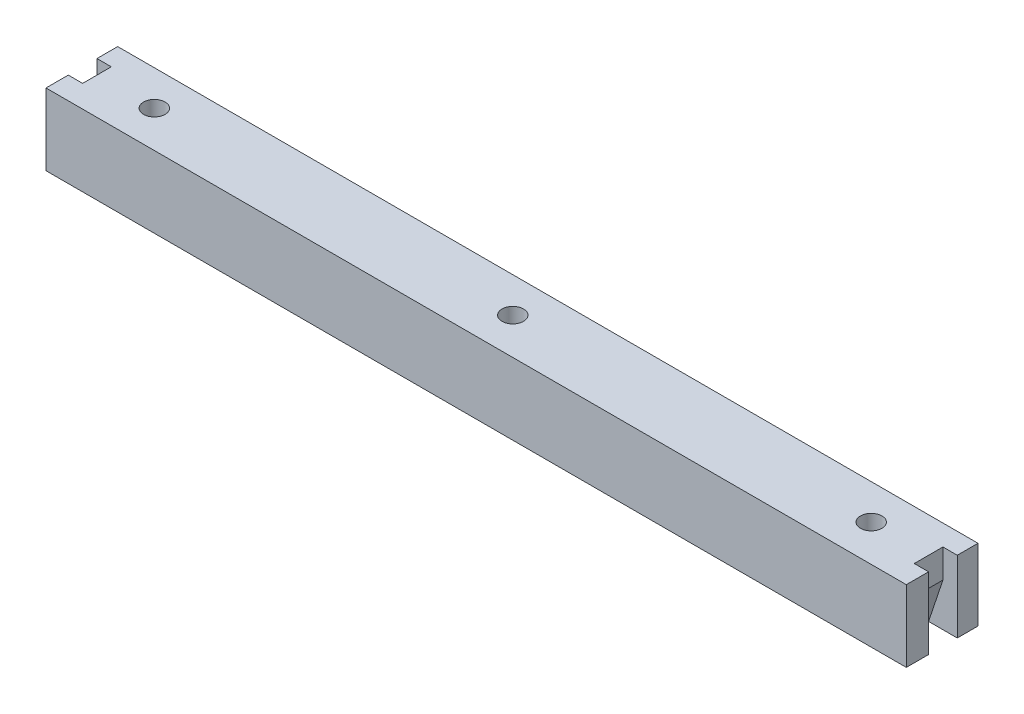
ISO-10303-21;
HEADER;
FILE_DESCRIPTION(('STEP AP214'),'2;1');
FILE_NAME('part.step','',(''),(''),'','','');
FILE_SCHEMA(('AUTOMOTIVE_DESIGN { 1 0 10303 214 1 1 1 1 }'));
ENDSEC;
DATA;
#1=APPLICATION_CONTEXT('core data for automotive mechanical design processes');
#2=APPLICATION_PROTOCOL_DEFINITION('international standard','automotive_design',2000,#1);
#3=PRODUCT_CONTEXT('',#1,'mechanical');
#4=PRODUCT('Part','Part','',(#3));
#5=PRODUCT_RELATED_PRODUCT_CATEGORY('part','',(#4));
#6=PRODUCT_DEFINITION_FORMATION('','',#4);
#7=PRODUCT_DEFINITION_CONTEXT('part definition',#1,'design');
#8=PRODUCT_DEFINITION('design','',#6,#7);
#9=PRODUCT_DEFINITION_SHAPE('','',#8);
#10=(LENGTH_UNIT() NAMED_UNIT(*) SI_UNIT(.MILLI.,.METRE.));
#11=(NAMED_UNIT(*) PLANE_ANGLE_UNIT() SI_UNIT($,.RADIAN.));
#12=(NAMED_UNIT(*) SI_UNIT($,.STERADIAN.) SOLID_ANGLE_UNIT());
#13=UNCERTAINTY_MEASURE_WITH_UNIT(LENGTH_MEASURE(1.E-05),#10,'distance_accuracy_value','');
#14=(GEOMETRIC_REPRESENTATION_CONTEXT(3) GLOBAL_UNCERTAINTY_ASSIGNED_CONTEXT((#13)) GLOBAL_UNIT_ASSIGNED_CONTEXT((#10,
#11,#12)) REPRESENTATION_CONTEXT('',''));
#15=CARTESIAN_POINT('',(0.,0.,0.));
#16=DIRECTION('',(0.,0.,1.));
#17=DIRECTION('',(1.,0.,0.));
#18=AXIS2_PLACEMENT_3D('',#15,#16,#17);
#19=CARTESIAN_POINT('',(60.,10.,-4.89208633093525));
#20=DIRECTION('',(-1.,0.,0.));
#21=DIRECTION('',(0.,0.,1.));
#22=AXIS2_PLACEMENT_3D('',#19,#20,#21);
#23=PLANE('',#22);
#24=DIRECTION('',(0.,1.,0.));
#25=VECTOR('',#24,1.);
#26=CARTESIAN_POINT('',(60.,10.,-2.));
#27=LINE('',#26,#25);
#28=CARTESIAN_POINT('',(60.,0.,-2.));
#29=VERTEX_POINT('',#28);
#30=CARTESIAN_POINT('',(60.,10.,-2.));
#31=VERTEX_POINT('',#30);
#32=EDGE_CURVE('E254',#29,#31,#27,.T.);
#33=ORIENTED_EDGE('',*,*,#32,.F.);
#34=DIRECTION('',(0.,0.,-1.));
#35=VECTOR('',#34,1.);
#36=CARTESIAN_POINT('',(60.,0.,-4.89208633093525));
#37=LINE('',#36,#35);
#38=CARTESIAN_POINT('',(60.,0.,-4.89208633093525));
#39=VERTEX_POINT('',#38);
#40=EDGE_CURVE('E230',#29,#39,#37,.T.);
#41=ORIENTED_EDGE('',*,*,#40,.T.);
#42=DIRECTION('',(0.,-1.,0.));
#43=VECTOR('',#42,1.);
#44=CARTESIAN_POINT('',(60.,10.,-4.89208633093525));
#45=LINE('',#44,#43);
#46=CARTESIAN_POINT('',(60.,10.,-4.89208633093525));
#47=VERTEX_POINT('',#46);
#48=EDGE_CURVE('E238',#47,#39,#45,.T.);
#49=ORIENTED_EDGE('',*,*,#48,.F.);
#50=DIRECTION('',(0.,0.,-1.));
#51=VECTOR('',#50,1.);
#52=CARTESIAN_POINT('',(60.,10.,-4.89208633093525));
#53=LINE('',#52,#51);
#54=EDGE_CURVE('E218',#31,#47,#53,.T.);
#55=ORIENTED_EDGE('',*,*,#54,.F.);
#56=EDGE_LOOP('',(#33,#41,#49,#55));
#57=FACE_BOUND('',#56,.T.);
#58=ADVANCED_FACE('F33',(#57),#23,.F.);
#59=CARTESIAN_POINT('',(0.,10.,0.));
#60=DIRECTION('',(0.,1.,0.));
#61=DIRECTION('',(0.,0.,1.));
#62=AXIS2_PLACEMENT_3D('',#59,#60,#61);
#63=PLANE('',#62);
#64=DIRECTION('',(1.,0.,0.));
#65=VECTOR('',#64,1.);
#66=CARTESIAN_POINT('',(0.,10.,2.));
#67=LINE('',#66,#65);
#68=CARTESIAN_POINT('',(58.,10.,2.));
#69=VERTEX_POINT('',#68);
#70=CARTESIAN_POINT('',(60.,10.,2.));
#71=VERTEX_POINT('',#70);
#72=EDGE_CURVE('E166',#69,#71,#67,.T.);
#73=ORIENTED_EDGE('',*,*,#72,.F.);
#74=DIRECTION('',(0.,0.,-1.));
#75=VECTOR('',#74,1.);
#76=CARTESIAN_POINT('',(58.,10.,0.));
#77=LINE('',#76,#75);
#78=CARTESIAN_POINT('',(58.,10.,-2.));
#79=VERTEX_POINT('',#78);
#80=EDGE_CURVE('E11',#69,#79,#77,.T.);
#81=ORIENTED_EDGE('',*,*,#80,.T.);
#82=DIRECTION('',(1.,0.,0.));
#83=VECTOR('',#82,1.);
#84=CARTESIAN_POINT('',(0.,10.,-2.));
#85=LINE('',#84,#83);
#86=EDGE_CURVE('E140',#79,#31,#85,.T.);
#87=ORIENTED_EDGE('',*,*,#86,.T.);
#88=ORIENTED_EDGE('',*,*,#54,.T.);
#89=DIRECTION('',(-1.,0.,0.));
#90=VECTOR('',#89,1.);
#91=CARTESIAN_POINT('',(-60.,10.,-4.89208633093525));
#92=LINE('',#91,#90);
#93=CARTESIAN_POINT('',(-60.,10.,-4.89208633093525));
#94=VERTEX_POINT('',#93);
#95=EDGE_CURVE('E222',#47,#94,#92,.T.);
#96=ORIENTED_EDGE('',*,*,#95,.T.);
#97=DIRECTION('',(0.,0.,1.));
#98=VECTOR('',#97,1.);
#99=CARTESIAN_POINT('',(-60.,10.,-4.89208633093525));
#100=LINE('',#99,#98);
#101=CARTESIAN_POINT('',(-60.,10.,-2.));
#102=VERTEX_POINT('',#101);
#103=EDGE_CURVE('E212',#94,#102,#100,.T.);
#104=ORIENTED_EDGE('',*,*,#103,.T.);
#105=DIRECTION('',(-1.,0.,0.));
#106=VECTOR('',#105,1.);
#107=CARTESIAN_POINT('',(0.,10.,-2.));
#108=LINE('',#107,#106);
#109=CARTESIAN_POINT('',(-58.,10.,-2.));
#110=VERTEX_POINT('',#109);
#111=EDGE_CURVE('E56',#110,#102,#108,.T.);
#112=ORIENTED_EDGE('',*,*,#111,.F.);
#113=DIRECTION('',(0.,0.,1.));
#114=VECTOR('',#113,1.);
#115=CARTESIAN_POINT('',(-58.,10.,0.));
#116=LINE('',#115,#114);
#117=CARTESIAN_POINT('',(-58.,10.,2.));
#118=VERTEX_POINT('',#117);
#119=EDGE_CURVE('E251',#110,#118,#116,.T.);
#120=ORIENTED_EDGE('',*,*,#119,.T.);
#121=DIRECTION('',(-1.,0.,0.));
#122=VECTOR('',#121,1.);
#123=CARTESIAN_POINT('',(0.,10.,2.));
#124=LINE('',#123,#122);
#125=CARTESIAN_POINT('',(-60.,10.,2.));
#126=VERTEX_POINT('',#125);
#127=EDGE_CURVE('E190',#118,#126,#124,.T.);
#128=ORIENTED_EDGE('',*,*,#127,.T.);
#129=CARTESIAN_POINT('',(-60.,10.,5.10791366906475));
#130=VERTEX_POINT('',#129);
#131=EDGE_CURVE('E216',#126,#130,#100,.T.);
#132=ORIENTED_EDGE('',*,*,#131,.T.);
#133=DIRECTION('',(1.,0.,0.));
#134=VECTOR('',#133,1.);
#135=CARTESIAN_POINT('',(-60.,10.,5.10791366906475));
#136=LINE('',#135,#134);
#137=CARTESIAN_POINT('',(60.,10.,5.10791366906475));
#138=VERTEX_POINT('',#137);
#139=EDGE_CURVE('E215',#130,#138,#136,.T.);
#140=ORIENTED_EDGE('',*,*,#139,.T.);
#141=EDGE_CURVE('E219',#138,#71,#53,.T.);
#142=ORIENTED_EDGE('',*,*,#141,.T.);
#143=EDGE_LOOP('',(#73,#81,#87,#88,#96,#104,#112,#120,#128,#132,#140,#142));
#144=FACE_BOUND('',#143,.T.);
#145=CARTESIAN_POINT('',(50.,10.,0.));
#146=DIRECTION('',(0.,1.,0.));
#147=DIRECTION('',(0.,0.,1.));
#148=AXIS2_PLACEMENT_3D('',#145,#146,#147);
#149=CIRCLE('',#148,1.5);
#150=CARTESIAN_POINT('',(50.,10.,1.5));
#151=VERTEX_POINT('',#150);
#152=EDGE_CURVE('E194',#151,#151,#149,.T.);
#153=ORIENTED_EDGE('',*,*,#152,.F.);
#154=EDGE_LOOP('',(#153));
#155=FACE_BOUND('',#154,.T.);
#156=CARTESIAN_POINT('',(-50.,10.,0.));
#157=DIRECTION('',(0.,1.,0.));
#158=DIRECTION('',(0.,0.,1.));
#159=AXIS2_PLACEMENT_3D('',#156,#157,#158);
#160=CIRCLE('',#159,1.5);
#161=CARTESIAN_POINT('',(-50.,10.,1.5));
#162=VERTEX_POINT('',#161);
#163=EDGE_CURVE('E206',#162,#162,#160,.T.);
#164=ORIENTED_EDGE('',*,*,#163,.F.);
#165=EDGE_LOOP('',(#164));
#166=FACE_BOUND('',#165,.T.);
#167=CARTESIAN_POINT('',(0.,10.,0.));
#168=DIRECTION('',(0.,1.,0.));
#169=DIRECTION('',(0.,0.,1.));
#170=AXIS2_PLACEMENT_3D('',#167,#168,#169);
#171=CIRCLE('',#170,1.5);
#172=CARTESIAN_POINT('',(0.,10.,1.5));
#173=VERTEX_POINT('',#172);
#174=EDGE_CURVE('E200',#173,#173,#171,.T.);
#175=ORIENTED_EDGE('',*,*,#174,.F.);
#176=EDGE_LOOP('',(#175));
#177=FACE_BOUND('',#176,.T.);
#178=ADVANCED_FACE('F263',(#144,#155,#166,#177),#63,.T.);
#179=CARTESIAN_POINT('',(0.,0.,0.));
#180=DIRECTION('',(0.,1.,0.));
#181=DIRECTION('',(0.,0.,1.));
#182=AXIS2_PLACEMENT_3D('',#179,#180,#181);
#183=PLANE('',#182);
#184=CARTESIAN_POINT('',(50.,0.,0.));
#185=DIRECTION('',(0.,1.,0.));
#186=DIRECTION('',(0.,0.,1.));
#187=AXIS2_PLACEMENT_3D('',#184,#185,#186);
#188=CIRCLE('',#187,1.5);
#189=CARTESIAN_POINT('',(50.,0.,1.5));
#190=VERTEX_POINT('',#189);
#191=EDGE_CURVE('E193',#190,#190,#188,.T.);
#192=ORIENTED_EDGE('',*,*,#191,.T.);
#193=EDGE_LOOP('',(#192));
#194=FACE_BOUND('',#193,.T.);
#195=CARTESIAN_POINT('',(-50.,0.,0.));
#196=DIRECTION('',(0.,1.,0.));
#197=DIRECTION('',(0.,0.,1.));
#198=AXIS2_PLACEMENT_3D('',#195,#196,#197);
#199=CIRCLE('',#198,1.5);
#200=CARTESIAN_POINT('',(-50.,0.,1.5));
#201=VERTEX_POINT('',#200);
#202=EDGE_CURVE('E203',#201,#201,#199,.T.);
#203=ORIENTED_EDGE('',*,*,#202,.T.);
#204=EDGE_LOOP('',(#203));
#205=FACE_BOUND('',#204,.T.);
#206=CARTESIAN_POINT('',(0.,0.,0.));
#207=DIRECTION('',(0.,1.,0.));
#208=DIRECTION('',(0.,0.,1.));
#209=AXIS2_PLACEMENT_3D('',#206,#207,#208);
#210=CIRCLE('',#209,1.5);
#211=CARTESIAN_POINT('',(0.,0.,1.5));
#212=VERTEX_POINT('',#211);
#213=EDGE_CURVE('E197',#212,#212,#210,.T.);
#214=ORIENTED_EDGE('',*,*,#213,.T.);
#215=EDGE_LOOP('',(#214));
#216=FACE_BOUND('',#215,.T.);
#217=DIRECTION('',(0.,0.,-1.));
#218=VECTOR('',#217,1.);
#219=CARTESIAN_POINT('',(56.,0.,2.));
#220=LINE('',#219,#218);
#221=CARTESIAN_POINT('',(56.,0.,2.));
#222=VERTEX_POINT('',#221);
#223=CARTESIAN_POINT('',(56.,0.,-2.));
#224=VERTEX_POINT('',#223);
#225=EDGE_CURVE('E151',#222,#224,#220,.T.);
#226=ORIENTED_EDGE('',*,*,#225,.F.);
#227=DIRECTION('',(1.,0.,0.));
#228=VECTOR('',#227,1.);
#229=CARTESIAN_POINT('',(0.,0.,2.));
#230=LINE('',#229,#228);
#231=CARTESIAN_POINT('',(60.,0.,2.));
#232=VERTEX_POINT('',#231);
#233=EDGE_CURVE('E163',#222,#232,#230,.T.);
#234=ORIENTED_EDGE('',*,*,#233,.T.);
#235=CARTESIAN_POINT('',(60.,0.,5.10791366906475));
#236=VERTEX_POINT('',#235);
#237=EDGE_CURVE('E231',#236,#232,#37,.T.);
#238=ORIENTED_EDGE('',*,*,#237,.F.);
#239=DIRECTION('',(1.,0.,0.));
#240=VECTOR('',#239,1.);
#241=CARTESIAN_POINT('',(-60.,0.,5.10791366906475));
#242=LINE('',#241,#240);
#243=CARTESIAN_POINT('',(-60.,0.,5.10791366906475));
#244=VERTEX_POINT('',#243);
#245=EDGE_CURVE('E228',#244,#236,#242,.T.);
#246=ORIENTED_EDGE('',*,*,#245,.F.);
#247=DIRECTION('',(0.,0.,1.));
#248=VECTOR('',#247,1.);
#249=CARTESIAN_POINT('',(-60.,0.,-4.89208633093525));
#250=LINE('',#249,#248);
#251=CARTESIAN_POINT('',(-60.,0.,2.));
#252=VERTEX_POINT('',#251);
#253=EDGE_CURVE('E209',#252,#244,#250,.T.);
#254=ORIENTED_EDGE('',*,*,#253,.F.);
#255=DIRECTION('',(-1.,0.,0.));
#256=VECTOR('',#255,1.);
#257=CARTESIAN_POINT('',(0.,0.,2.));
#258=LINE('',#257,#256);
#259=CARTESIAN_POINT('',(-56.,0.,2.));
#260=VERTEX_POINT('',#259);
#261=EDGE_CURVE('E188',#260,#252,#258,.T.);
#262=ORIENTED_EDGE('',*,*,#261,.F.);
#263=DIRECTION('',(0.,0.,-1.));
#264=VECTOR('',#263,1.);
#265=CARTESIAN_POINT('',(-56.,0.,2.));
#266=LINE('',#265,#264);
#267=CARTESIAN_POINT('',(-56.,0.,-2.));
#268=VERTEX_POINT('',#267);
#269=EDGE_CURVE('E181',#260,#268,#266,.T.);
#270=ORIENTED_EDGE('',*,*,#269,.T.);
#271=DIRECTION('',(-1.,0.,0.));
#272=VECTOR('',#271,1.);
#273=CARTESIAN_POINT('',(0.,0.,-2.));
#274=LINE('',#273,#272);
#275=CARTESIAN_POINT('',(-60.,0.,-2.));
#276=VERTEX_POINT('',#275);
#277=EDGE_CURVE('E184',#268,#276,#274,.T.);
#278=ORIENTED_EDGE('',*,*,#277,.T.);
#279=CARTESIAN_POINT('',(-60.,0.,-4.89208633093525));
#280=VERTEX_POINT('',#279);
#281=EDGE_CURVE('E225',#280,#276,#250,.T.);
#282=ORIENTED_EDGE('',*,*,#281,.F.);
#283=DIRECTION('',(-1.,0.,0.));
#284=VECTOR('',#283,1.);
#285=CARTESIAN_POINT('',(-60.,0.,-4.89208633093525));
#286=LINE('',#285,#284);
#287=EDGE_CURVE('E234',#39,#280,#286,.T.);
#288=ORIENTED_EDGE('',*,*,#287,.F.);
#289=ORIENTED_EDGE('',*,*,#40,.F.);
#290=DIRECTION('',(1.,0.,0.));
#291=VECTOR('',#290,1.);
#292=CARTESIAN_POINT('',(0.,0.,-2.));
#293=LINE('',#292,#291);
#294=EDGE_CURVE('E48',#224,#29,#293,.T.);
#295=ORIENTED_EDGE('',*,*,#294,.F.);
#296=EDGE_LOOP('',(#226,#234,#238,#246,#254,#262,#270,#278,#282,#288,#289,#295));
#297=FACE_BOUND('',#296,.T.);
#298=ADVANCED_FACE('F273',(#194,#205,#216,#297),#183,.F.);
#299=CARTESIAN_POINT('',(-60.,10.,-4.89208633093525));
#300=DIRECTION('',(1.,0.,0.));
#301=DIRECTION('',(0.,0.,-1.));
#302=AXIS2_PLACEMENT_3D('',#299,#300,#301);
#303=PLANE('',#302);
#304=DIRECTION('',(0.,1.,0.));
#305=VECTOR('',#304,1.);
#306=CARTESIAN_POINT('',(-60.,10.,2.));
#307=LINE('',#306,#305);
#308=EDGE_CURVE('E249',#252,#126,#307,.T.);
#309=ORIENTED_EDGE('',*,*,#308,.F.);
#310=ORIENTED_EDGE('',*,*,#253,.T.);
#311=DIRECTION('',(0.,-1.,0.));
#312=VECTOR('',#311,1.);
#313=CARTESIAN_POINT('',(-60.,10.,5.10791366906475));
#314=LINE('',#313,#312);
#315=EDGE_CURVE('E244',#130,#244,#314,.T.);
#316=ORIENTED_EDGE('',*,*,#315,.F.);
#317=ORIENTED_EDGE('',*,*,#131,.F.);
#318=EDGE_LOOP('',(#309,#310,#316,#317));
#319=FACE_BOUND('',#318,.T.);
#320=ADVANCED_FACE('F303',(#319),#303,.F.);
#321=ORIENTED_EDGE('',*,*,#281,.T.);
#322=DIRECTION('',(0.,1.,0.));
#323=VECTOR('',#322,1.);
#324=CARTESIAN_POINT('',(-60.,10.,-2.));
#325=LINE('',#324,#323);
#326=EDGE_CURVE('E247',#276,#102,#325,.T.);
#327=ORIENTED_EDGE('',*,*,#326,.T.);
#328=ORIENTED_EDGE('',*,*,#103,.F.);
#329=DIRECTION('',(0.,-1.,0.));
#330=VECTOR('',#329,1.);
#331=CARTESIAN_POINT('',(-60.,10.,-4.89208633093525));
#332=LINE('',#331,#330);
#333=EDGE_CURVE('E224',#94,#280,#332,.T.);
#334=ORIENTED_EDGE('',*,*,#333,.T.);
#335=EDGE_LOOP('',(#321,#327,#328,#334));
#336=FACE_BOUND('',#335,.T.);
#337=ADVANCED_FACE('F35',(#336),#303,.F.);
#338=CARTESIAN_POINT('',(-60.,10.,5.10791366906475));
#339=DIRECTION('',(0.,0.,-1.));
#340=DIRECTION('',(-1.,0.,0.));
#341=AXIS2_PLACEMENT_3D('',#338,#339,#340);
#342=PLANE('',#341);
#343=ORIENTED_EDGE('',*,*,#245,.T.);
#344=DIRECTION('',(0.,-1.,0.));
#345=VECTOR('',#344,1.);
#346=CARTESIAN_POINT('',(60.,10.,5.10791366906475));
#347=LINE('',#346,#345);
#348=EDGE_CURVE('E241',#138,#236,#347,.T.);
#349=ORIENTED_EDGE('',*,*,#348,.F.);
#350=ORIENTED_EDGE('',*,*,#139,.F.);
#351=ORIENTED_EDGE('',*,*,#315,.T.);
#352=EDGE_LOOP('',(#343,#349,#350,#351));
#353=FACE_BOUND('',#352,.T.);
#354=ADVANCED_FACE('F270',(#353),#342,.F.);
#355=ORIENTED_EDGE('',*,*,#237,.T.);
#356=DIRECTION('',(0.,1.,0.));
#357=VECTOR('',#356,1.);
#358=CARTESIAN_POINT('',(60.,10.,2.));
#359=LINE('',#358,#357);
#360=EDGE_CURVE('E41',#232,#71,#359,.T.);
#361=ORIENTED_EDGE('',*,*,#360,.T.);
#362=ORIENTED_EDGE('',*,*,#141,.F.);
#363=ORIENTED_EDGE('',*,*,#348,.T.);
#364=EDGE_LOOP('',(#355,#361,#362,#363));
#365=FACE_BOUND('',#364,.T.);
#366=ADVANCED_FACE('F258',(#365),#23,.F.);
#367=CARTESIAN_POINT('',(-60.,10.,-4.89208633093525));
#368=DIRECTION('',(0.,0.,1.));
#369=DIRECTION('',(1.,0.,0.));
#370=AXIS2_PLACEMENT_3D('',#367,#368,#369);
#371=PLANE('',#370);
#372=ORIENTED_EDGE('',*,*,#287,.T.);
#373=ORIENTED_EDGE('',*,*,#333,.F.);
#374=ORIENTED_EDGE('',*,*,#95,.F.);
#375=ORIENTED_EDGE('',*,*,#48,.T.);
#376=EDGE_LOOP('',(#372,#373,#374,#375));
#377=FACE_BOUND('',#376,.T.);
#378=ADVANCED_FACE('F293',(#377),#371,.F.);
#379=CARTESIAN_POINT('',(-50.,10.,0.));
#380=DIRECTION('',(0.,-1.,0.));
#381=DIRECTION('',(0.,0.,-1.));
#382=AXIS2_PLACEMENT_3D('',#379,#380,#381);
#383=CYLINDRICAL_SURFACE('',#382,1.5);
#384=ORIENTED_EDGE('',*,*,#163,.T.);
#385=EDGE_LOOP('',(#384));
#386=FACE_BOUND('',#385,.T.);
#387=ORIENTED_EDGE('',*,*,#202,.F.);
#388=EDGE_LOOP('',(#387));
#389=FACE_BOUND('',#388,.T.);
#390=ADVANCED_FACE('F298',(#386,#389),#383,.F.);
#391=CARTESIAN_POINT('',(0.,10.,0.));
#392=DIRECTION('',(0.,-1.,0.));
#393=DIRECTION('',(0.,0.,-1.));
#394=AXIS2_PLACEMENT_3D('',#391,#392,#393);
#395=CYLINDRICAL_SURFACE('',#394,1.5);
#396=ORIENTED_EDGE('',*,*,#174,.T.);
#397=EDGE_LOOP('',(#396));
#398=FACE_BOUND('',#397,.T.);
#399=ORIENTED_EDGE('',*,*,#213,.F.);
#400=EDGE_LOOP('',(#399));
#401=FACE_BOUND('',#400,.T.);
#402=ADVANCED_FACE('F345',(#398,#401),#395,.F.);
#403=CARTESIAN_POINT('',(50.,10.,0.));
#404=DIRECTION('',(0.,-1.,0.));
#405=DIRECTION('',(0.,0.,-1.));
#406=AXIS2_PLACEMENT_3D('',#403,#404,#405);
#407=CYLINDRICAL_SURFACE('',#406,1.5);
#408=ORIENTED_EDGE('',*,*,#152,.T.);
#409=EDGE_LOOP('',(#408));
#410=FACE_BOUND('',#409,.T.);
#411=ORIENTED_EDGE('',*,*,#191,.F.);
#412=EDGE_LOOP('',(#411));
#413=FACE_BOUND('',#412,.T.);
#414=ADVANCED_FACE('F342',(#410,#413),#407,.F.);
#415=CARTESIAN_POINT('',(-58.,6.,2.));
#416=DIRECTION('',(-0.948683298050514,-0.316227766016838,0.));
#417=DIRECTION('',(0.316227766016838,-0.948683298050514,0.));
#418=AXIS2_PLACEMENT_3D('',#415,#416,#417);
#419=PLANE('',#418);
#420=ORIENTED_EDGE('',*,*,#269,.F.);
#421=DIRECTION('',(-0.316227766016838,0.948683298050514,0.));
#422=VECTOR('',#421,1.);
#423=CARTESIAN_POINT('',(-58.,6.,2.));
#424=LINE('',#423,#422);
#425=CARTESIAN_POINT('',(-58.,6.,2.));
#426=VERTEX_POINT('',#425);
#427=EDGE_CURVE('E176',#260,#426,#424,.T.);
#428=ORIENTED_EDGE('',*,*,#427,.T.);
#429=DIRECTION('',(0.,0.,-1.));
#430=VECTOR('',#429,1.);
#431=CARTESIAN_POINT('',(-58.,6.,2.));
#432=LINE('',#431,#430);
#433=CARTESIAN_POINT('',(-58.,6.,-2.));
#434=VERTEX_POINT('',#433);
#435=EDGE_CURVE('E179',#426,#434,#432,.T.);
#436=ORIENTED_EDGE('',*,*,#435,.T.);
#437=DIRECTION('',(-0.316227766016838,0.948683298050514,0.));
#438=VECTOR('',#437,1.);
#439=CARTESIAN_POINT('',(-58.,6.,-2.));
#440=LINE('',#439,#438);
#441=EDGE_CURVE('E170',#268,#434,#440,.T.);
#442=ORIENTED_EDGE('',*,*,#441,.F.);
#443=EDGE_LOOP('',(#420,#428,#436,#442));
#444=FACE_BOUND('',#443,.T.);
#445=ADVANCED_FACE('F318',(#444),#419,.T.);
#446=CARTESIAN_POINT('',(-58.,10.,2.));
#447=DIRECTION('',(-1.,0.,0.));
#448=DIRECTION('',(0.,0.,1.));
#449=AXIS2_PLACEMENT_3D('',#446,#447,#448);
#450=PLANE('',#449);
#451=DIRECTION('',(0.,1.,0.));
#452=VECTOR('',#451,1.);
#453=CARTESIAN_POINT('',(-58.,18.3399799906114,-2.));
#454=LINE('',#453,#452);
#455=EDGE_CURVE('E168',#434,#110,#454,.T.);
#456=ORIENTED_EDGE('',*,*,#455,.F.);
#457=ORIENTED_EDGE('',*,*,#435,.F.);
#458=DIRECTION('',(0.,1.,0.));
#459=VECTOR('',#458,1.);
#460=CARTESIAN_POINT('',(-58.,18.3399799906114,2.));
#461=LINE('',#460,#459);
#462=EDGE_CURVE('E173',#426,#118,#461,.T.);
#463=ORIENTED_EDGE('',*,*,#462,.T.);
#464=ORIENTED_EDGE('',*,*,#119,.F.);
#465=EDGE_LOOP('',(#456,#457,#463,#464));
#466=FACE_BOUND('',#465,.T.);
#467=ADVANCED_FACE('F323',(#466),#450,.T.);
#468=CARTESIAN_POINT('',(0.,0.,2.));
#469=DIRECTION('',(0.,0.,-1.));
#470=DIRECTION('',(-1.,0.,0.));
#471=AXIS2_PLACEMENT_3D('',#468,#469,#470);
#472=PLANE('',#471);
#473=ORIENTED_EDGE('',*,*,#462,.F.);
#474=ORIENTED_EDGE('',*,*,#427,.F.);
#475=ORIENTED_EDGE('',*,*,#261,.T.);
#476=ORIENTED_EDGE('',*,*,#308,.T.);
#477=ORIENTED_EDGE('',*,*,#127,.F.);
#478=EDGE_LOOP('',(#473,#474,#475,#476,#477));
#479=FACE_BOUND('',#478,.T.);
#480=ADVANCED_FACE('F329',(#479),#472,.T.);
#481=CARTESIAN_POINT('',(0.,0.,-2.));
#482=DIRECTION('',(0.,0.,-1.));
#483=DIRECTION('',(-1.,0.,0.));
#484=AXIS2_PLACEMENT_3D('',#481,#482,#483);
#485=PLANE('',#484);
#486=ORIENTED_EDGE('',*,*,#111,.T.);
#487=ORIENTED_EDGE('',*,*,#326,.F.);
#488=ORIENTED_EDGE('',*,*,#277,.F.);
#489=ORIENTED_EDGE('',*,*,#441,.T.);
#490=ORIENTED_EDGE('',*,*,#455,.T.);
#491=EDGE_LOOP('',(#486,#487,#488,#489,#490));
#492=FACE_BOUND('',#491,.T.);
#493=ADVANCED_FACE('F316',(#492),#485,.F.);
#494=CARTESIAN_POINT('',(58.,10.,2.));
#495=DIRECTION('',(1.,0.,0.));
#496=DIRECTION('',(0.,0.,-1.));
#497=AXIS2_PLACEMENT_3D('',#494,#495,#496);
#498=PLANE('',#497);
#499=DIRECTION('',(0.,-1.,0.));
#500=VECTOR('',#499,1.);
#501=CARTESIAN_POINT('',(58.,18.3399799906114,2.));
#502=LINE('',#501,#500);
#503=CARTESIAN_POINT('',(58.,6.,2.));
#504=VERTEX_POINT('',#503);
#505=EDGE_CURVE('E147',#69,#504,#502,.T.);
#506=ORIENTED_EDGE('',*,*,#505,.T.);
#507=DIRECTION('',(0.,0.,-1.));
#508=VECTOR('',#507,1.);
#509=CARTESIAN_POINT('',(58.,6.,2.));
#510=LINE('',#509,#508);
#511=CARTESIAN_POINT('',(58.,6.,-2.));
#512=VERTEX_POINT('',#511);
#513=EDGE_CURVE('E144',#504,#512,#510,.T.);
#514=ORIENTED_EDGE('',*,*,#513,.T.);
#515=DIRECTION('',(0.,-1.,0.));
#516=VECTOR('',#515,1.);
#517=CARTESIAN_POINT('',(58.,18.3399799906114,-2.));
#518=LINE('',#517,#516);
#519=EDGE_CURVE('E134',#79,#512,#518,.T.);
#520=ORIENTED_EDGE('',*,*,#519,.F.);
#521=ORIENTED_EDGE('',*,*,#80,.F.);
#522=EDGE_LOOP('',(#506,#514,#520,#521));
#523=FACE_BOUND('',#522,.T.);
#524=ADVANCED_FACE('F145',(#523),#498,.T.);
#525=CARTESIAN_POINT('',(58.,6.,2.));
#526=DIRECTION('',(0.948683298050514,-0.316227766016838,0.));
#527=DIRECTION('',(0.316227766016838,0.948683298050514,0.));
#528=AXIS2_PLACEMENT_3D('',#525,#526,#527);
#529=PLANE('',#528);
#530=ORIENTED_EDGE('',*,*,#513,.F.);
#531=DIRECTION('',(-0.316227766016838,-0.948683298050514,0.));
#532=VECTOR('',#531,1.);
#533=CARTESIAN_POINT('',(58.,6.,2.));
#534=LINE('',#533,#532);
#535=EDGE_CURVE('E156',#504,#222,#534,.T.);
#536=ORIENTED_EDGE('',*,*,#535,.T.);
#537=ORIENTED_EDGE('',*,*,#225,.T.);
#538=DIRECTION('',(-0.316227766016838,-0.948683298050514,0.));
#539=VECTOR('',#538,1.);
#540=CARTESIAN_POINT('',(58.,6.,-2.));
#541=LINE('',#540,#539);
#542=EDGE_CURVE('E138',#512,#224,#541,.T.);
#543=ORIENTED_EDGE('',*,*,#542,.F.);
#544=EDGE_LOOP('',(#530,#536,#537,#543));
#545=FACE_BOUND('',#544,.T.);
#546=ADVANCED_FACE('F153',(#545),#529,.T.);
#547=CARTESIAN_POINT('',(0.,0.,2.));
#548=DIRECTION('',(0.,0.,1.));
#549=DIRECTION('',(1.,0.,0.));
#550=AXIS2_PLACEMENT_3D('',#547,#548,#549);
#551=PLANE('',#550);
#552=ORIENTED_EDGE('',*,*,#72,.T.);
#553=ORIENTED_EDGE('',*,*,#360,.F.);
#554=ORIENTED_EDGE('',*,*,#233,.F.);
#555=ORIENTED_EDGE('',*,*,#535,.F.);
#556=ORIENTED_EDGE('',*,*,#505,.F.);
#557=EDGE_LOOP('',(#552,#553,#554,#555,#556));
#558=FACE_BOUND('',#557,.T.);
#559=ADVANCED_FACE('F275',(#558),#551,.F.);
#560=CARTESIAN_POINT('',(0.,0.,-2.));
#561=DIRECTION('',(0.,0.,1.));
#562=DIRECTION('',(1.,0.,0.));
#563=AXIS2_PLACEMENT_3D('',#560,#561,#562);
#564=PLANE('',#563);
#565=ORIENTED_EDGE('',*,*,#519,.T.);
#566=ORIENTED_EDGE('',*,*,#542,.T.);
#567=ORIENTED_EDGE('',*,*,#294,.T.);
#568=ORIENTED_EDGE('',*,*,#32,.T.);
#569=ORIENTED_EDGE('',*,*,#86,.F.);
#570=EDGE_LOOP('',(#565,#566,#567,#568,#569));
#571=FACE_BOUND('',#570,.T.);
#572=ADVANCED_FACE('F136',(#571),#564,.T.);
#573=CLOSED_SHELL('',(#58,#178,#298,#320,#337,#354,#366,#378,#390,#402,#414,#445,#467,#480,#493,
#524,#546,#559,#572));
#574=MANIFOLD_SOLID_BREP('B2',#573);
#575=ADVANCED_BREP_SHAPE_REPRESENTATION('',(#18,#574),#14);
#576=SHAPE_DEFINITION_REPRESENTATION(#9,#575);
ENDSEC;
END-ISO-10303-21;
